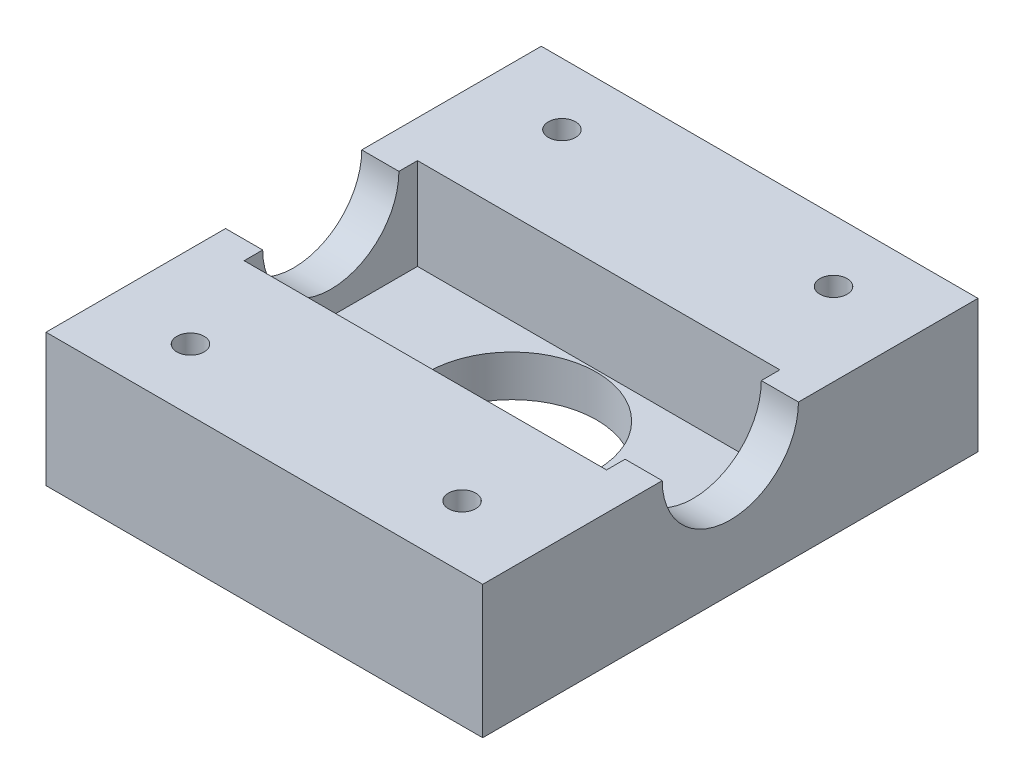
ISO-10303-21;
HEADER;
FILE_DESCRIPTION(('STEP AP214'),'2;1');
FILE_NAME('part.step','',(''),(''),'','','');
FILE_SCHEMA(('AUTOMOTIVE_DESIGN { 1 0 10303 214 1 1 1 1 }'));
ENDSEC;
DATA;
#1=APPLICATION_CONTEXT('core data for automotive mechanical design processes');
#2=APPLICATION_PROTOCOL_DEFINITION('international standard','automotive_design',2000,#1);
#3=PRODUCT_CONTEXT('',#1,'mechanical');
#4=PRODUCT('Part','Part','',(#3));
#5=PRODUCT_RELATED_PRODUCT_CATEGORY('part','',(#4));
#6=PRODUCT_DEFINITION_FORMATION('','',#4);
#7=PRODUCT_DEFINITION_CONTEXT('part definition',#1,'design');
#8=PRODUCT_DEFINITION('design','',#6,#7);
#9=PRODUCT_DEFINITION_SHAPE('','',#8);
#10=(LENGTH_UNIT() NAMED_UNIT(*) SI_UNIT(.MILLI.,.METRE.));
#11=(NAMED_UNIT(*) PLANE_ANGLE_UNIT() SI_UNIT($,.RADIAN.));
#12=(NAMED_UNIT(*) SI_UNIT($,.STERADIAN.) SOLID_ANGLE_UNIT());
#13=UNCERTAINTY_MEASURE_WITH_UNIT(LENGTH_MEASURE(1.E-05),#10,'distance_accuracy_value','');
#14=(GEOMETRIC_REPRESENTATION_CONTEXT(3) GLOBAL_UNCERTAINTY_ASSIGNED_CONTEXT((#13)) GLOBAL_UNIT_ASSIGNED_CONTEXT((#10,
#11,#12)) REPRESENTATION_CONTEXT('',''));
#15=CARTESIAN_POINT('',(0.,0.,0.));
#16=DIRECTION('',(0.,0.,1.));
#17=DIRECTION('',(1.,0.,0.));
#18=AXIS2_PLACEMENT_3D('',#15,#16,#17);
#19=CARTESIAN_POINT('',(0.,16.1,0.));
#20=DIRECTION('',(0.,1.,0.));
#21=DIRECTION('',(0.,0.,1.));
#22=AXIS2_PLACEMENT_3D('',#19,#20,#21);
#23=PLANE('',#22);
#24=CARTESIAN_POINT('',(-16.45,16.1,22.5));
#25=DIRECTION('',(0.,1.,0.));
#26=DIRECTION('',(0.,0.,1.));
#27=AXIS2_PLACEMENT_3D('',#24,#25,#26);
#28=CIRCLE('',#27,1.64999999999999);
#29=CARTESIAN_POINT('',(-16.45,16.1,24.15));
#30=VERTEX_POINT('',#29);
#31=EDGE_CURVE('E162',#30,#30,#28,.T.);
#32=ORIENTED_EDGE('',*,*,#31,.F.);
#33=EDGE_LOOP('',(#32));
#34=FACE_BOUND('',#33,.T.);
#35=CARTESIAN_POINT('',(16.45,16.1,22.5));
#36=DIRECTION('',(0.,1.,0.));
#37=DIRECTION('',(0.,0.,1.));
#38=AXIS2_PLACEMENT_3D('',#35,#36,#37);
#39=CIRCLE('',#38,1.64999999999999);
#40=CARTESIAN_POINT('',(16.45,16.1,24.15));
#41=VERTEX_POINT('',#40);
#42=EDGE_CURVE('E161',#41,#41,#39,.T.);
#43=ORIENTED_EDGE('',*,*,#42,.F.);
#44=EDGE_LOOP('',(#43));
#45=FACE_BOUND('',#44,.T.);
#46=DIRECTION('',(1.,0.,0.));
#47=VECTOR('',#46,1.);
#48=CARTESIAN_POINT('',(-26.45,16.1,8.25000000000002));
#49=LINE('',#48,#47);
#50=CARTESIAN_POINT('',(-26.45,16.1,8.25000000000002));
#51=VERTEX_POINT('',#50);
#52=CARTESIAN_POINT('',(-21.95,16.1,8.25000000000001));
#53=VERTEX_POINT('',#52);
#54=EDGE_CURVE('E67',#51,#53,#49,.T.);
#55=ORIENTED_EDGE('',*,*,#54,.F.);
#56=DIRECTION('',(0.,0.,1.));
#57=VECTOR('',#56,1.);
#58=CARTESIAN_POINT('',(-26.45,16.1,-15.));
#59=LINE('',#58,#57);
#60=CARTESIAN_POINT('',(-26.45,16.1,30.));
#61=VERTEX_POINT('',#60);
#62=EDGE_CURVE('E284',#51,#61,#59,.T.);
#63=ORIENTED_EDGE('',*,*,#62,.T.);
#64=DIRECTION('',(-1.,0.,0.));
#65=VECTOR('',#64,1.);
#66=CARTESIAN_POINT('',(-26.45,16.1,30.));
#67=LINE('',#66,#65);
#68=CARTESIAN_POINT('',(26.45,16.1,30.));
#69=VERTEX_POINT('',#68);
#70=EDGE_CURVE('E220',#69,#61,#67,.T.);
#71=ORIENTED_EDGE('',*,*,#70,.F.);
#72=DIRECTION('',(0.,0.,-1.));
#73=VECTOR('',#72,1.);
#74=CARTESIAN_POINT('',(26.45,16.1,-15.));
#75=LINE('',#74,#73);
#76=CARTESIAN_POINT('',(26.45,16.1,8.25));
#77=VERTEX_POINT('',#76);
#78=EDGE_CURVE('E290',#69,#77,#75,.T.);
#79=ORIENTED_EDGE('',*,*,#78,.T.);
#80=CARTESIAN_POINT('',(21.95,16.1,8.25));
#81=VERTEX_POINT('',#80);
#82=EDGE_CURVE('E233',#81,#77,#49,.T.);
#83=ORIENTED_EDGE('',*,*,#82,.F.);
#84=DIRECTION('',(0.,0.,-1.));
#85=VECTOR('',#84,1.);
#86=CARTESIAN_POINT('',(21.95,16.1,-10.5));
#87=LINE('',#86,#85);
#88=CARTESIAN_POINT('',(21.95,16.1,10.5));
#89=VERTEX_POINT('',#88);
#90=EDGE_CURVE('E249',#89,#81,#87,.T.);
#91=ORIENTED_EDGE('',*,*,#90,.F.);
#92=DIRECTION('',(1.,0.,0.));
#93=VECTOR('',#92,1.);
#94=CARTESIAN_POINT('',(-21.95,16.1,10.5));
#95=LINE('',#94,#93);
#96=CARTESIAN_POINT('',(-21.95,16.1,10.5));
#97=VERTEX_POINT('',#96);
#98=EDGE_CURVE('E244',#97,#89,#95,.T.);
#99=ORIENTED_EDGE('',*,*,#98,.F.);
#100=DIRECTION('',(0.,0.,1.));
#101=VECTOR('',#100,1.);
#102=CARTESIAN_POINT('',(-21.95,16.1,-10.5));
#103=LINE('',#102,#101);
#104=EDGE_CURVE('E245',#53,#97,#103,.T.);
#105=ORIENTED_EDGE('',*,*,#104,.F.);
#106=EDGE_LOOP('',(#55,#63,#71,#79,#83,#91,#99,#105));
#107=FACE_BOUND('',#106,.T.);
#108=ADVANCED_FACE('F51',(#34,#45,#107),#23,.T.);
#109=CARTESIAN_POINT('',(0.,5.,0.));
#110=DIRECTION('',(0.,1.,0.));
#111=DIRECTION('',(0.,0.,1.));
#112=AXIS2_PLACEMENT_3D('',#109,#110,#111);
#113=PLANE('',#112);
#114=DIRECTION('',(0.,0.,1.));
#115=VECTOR('',#114,1.);
#116=CARTESIAN_POINT('',(-21.95,5.,-10.5));
#117=LINE('',#116,#115);
#118=CARTESIAN_POINT('',(-21.95,5.,-10.5));
#119=VERTEX_POINT('',#118);
#120=CARTESIAN_POINT('',(-21.95,5.,10.5));
#121=VERTEX_POINT('',#120);
#122=EDGE_CURVE('E257',#119,#121,#117,.T.);
#123=ORIENTED_EDGE('',*,*,#122,.T.);
#124=DIRECTION('',(1.,0.,0.));
#125=VECTOR('',#124,1.);
#126=CARTESIAN_POINT('',(-21.95,5.,10.5));
#127=LINE('',#126,#125);
#128=CARTESIAN_POINT('',(21.95,5.,10.5));
#129=VERTEX_POINT('',#128);
#130=EDGE_CURVE('E260',#121,#129,#127,.T.);
#131=ORIENTED_EDGE('',*,*,#130,.T.);
#132=DIRECTION('',(0.,0.,-1.));
#133=VECTOR('',#132,1.);
#134=CARTESIAN_POINT('',(21.95,5.,-10.5));
#135=LINE('',#134,#133);
#136=CARTESIAN_POINT('',(21.95,5.,-10.5));
#137=VERTEX_POINT('',#136);
#138=EDGE_CURVE('E263',#129,#137,#135,.T.);
#139=ORIENTED_EDGE('',*,*,#138,.T.);
#140=DIRECTION('',(-1.,0.,0.));
#141=VECTOR('',#140,1.);
#142=CARTESIAN_POINT('',(-21.95,5.,-10.5));
#143=LINE('',#142,#141);
#144=EDGE_CURVE('E266',#137,#119,#143,.T.);
#145=ORIENTED_EDGE('',*,*,#144,.T.);
#146=EDGE_LOOP('',(#123,#131,#139,#145));
#147=FACE_BOUND('',#146,.T.);
#148=CARTESIAN_POINT('',(0.,5.,0.));
#149=DIRECTION('',(0.,1.,0.));
#150=DIRECTION('',(0.,0.,1.));
#151=AXIS2_PLACEMENT_3D('',#148,#149,#150);
#152=CIRCLE('',#151,10.25);
#153=CARTESIAN_POINT('',(0.,5.,10.25));
#154=VERTEX_POINT('',#153);
#155=EDGE_CURVE('E295',#154,#154,#152,.T.);
#156=ORIENTED_EDGE('',*,*,#155,.F.);
#157=EDGE_LOOP('',(#156));
#158=FACE_BOUND('',#157,.T.);
#159=ADVANCED_FACE('F396',(#147,#158),#113,.T.);
#160=CARTESIAN_POINT('',(0.,0.,0.));
#161=DIRECTION('',(0.,1.,0.));
#162=DIRECTION('',(0.,0.,1.));
#163=AXIS2_PLACEMENT_3D('',#160,#161,#162);
#164=PLANE('',#163);
#165=DIRECTION('',(0.,0.,-1.));
#166=VECTOR('',#165,1.);
#167=CARTESIAN_POINT('',(26.45,0.,-15.));
#168=LINE('',#167,#166);
#169=CARTESIAN_POINT('',(26.45,0.,30.));
#170=VERTEX_POINT('',#169);
#171=CARTESIAN_POINT('',(26.45,0.,-30.));
#172=VERTEX_POINT('',#171);
#173=EDGE_CURVE('E299',#170,#172,#168,.T.);
#174=ORIENTED_EDGE('',*,*,#173,.F.);
#175=DIRECTION('',(1.,0.,0.));
#176=VECTOR('',#175,1.);
#177=CARTESIAN_POINT('',(26.45,0.,30.));
#178=LINE('',#177,#176);
#179=CARTESIAN_POINT('',(-26.45,0.,30.));
#180=VERTEX_POINT('',#179);
#181=EDGE_CURVE('E196',#180,#170,#178,.T.);
#182=ORIENTED_EDGE('',*,*,#181,.F.);
#183=DIRECTION('',(0.,0.,1.));
#184=VECTOR('',#183,1.);
#185=CARTESIAN_POINT('',(-26.45,0.,-15.));
#186=LINE('',#185,#184);
#187=CARTESIAN_POINT('',(-26.45,0.,-30.));
#188=VERTEX_POINT('',#187);
#189=EDGE_CURVE('E60',#188,#180,#186,.T.);
#190=ORIENTED_EDGE('',*,*,#189,.F.);
#191=DIRECTION('',(-1.,0.,0.));
#192=VECTOR('',#191,1.);
#193=CARTESIAN_POINT('',(-26.45,0.,-30.));
#194=LINE('',#193,#192);
#195=EDGE_CURVE('E192',#172,#188,#194,.T.);
#196=ORIENTED_EDGE('',*,*,#195,.F.);
#197=EDGE_LOOP('',(#174,#182,#190,#196));
#198=FACE_BOUND('',#197,.T.);
#199=CARTESIAN_POINT('',(0.,0.,0.));
#200=DIRECTION('',(0.,1.,0.));
#201=DIRECTION('',(0.,0.,1.));
#202=AXIS2_PLACEMENT_3D('',#199,#200,#201);
#203=CIRCLE('',#202,10.25);
#204=CARTESIAN_POINT('',(0.,0.,10.25));
#205=VERTEX_POINT('',#204);
#206=EDGE_CURVE('E294',#205,#205,#203,.T.);
#207=ORIENTED_EDGE('',*,*,#206,.T.);
#208=EDGE_LOOP('',(#207));
#209=FACE_BOUND('',#208,.T.);
#210=ADVANCED_FACE('F317',(#198,#209),#164,.F.);
#211=CARTESIAN_POINT('',(26.45,5.,-15.));
#212=DIRECTION('',(-1.,0.,0.));
#213=DIRECTION('',(0.,0.,1.));
#214=AXIS2_PLACEMENT_3D('',#211,#212,#213);
#215=PLANE('',#214);
#216=ORIENTED_EDGE('',*,*,#173,.T.);
#217=DIRECTION('',(0.,-1.,0.));
#218=VECTOR('',#217,1.);
#219=CARTESIAN_POINT('',(26.45,16.1,-30.));
#220=LINE('',#219,#218);
#221=CARTESIAN_POINT('',(26.45,16.1,-30.));
#222=VERTEX_POINT('',#221);
#223=EDGE_CURVE('E200',#222,#172,#220,.T.);
#224=ORIENTED_EDGE('',*,*,#223,.F.);
#225=CARTESIAN_POINT('',(26.45,16.1,-8.25));
#226=VERTEX_POINT('',#225);
#227=EDGE_CURVE('E289',#226,#222,#75,.T.);
#228=ORIENTED_EDGE('',*,*,#227,.F.);
#229=CARTESIAN_POINT('',(26.45,16.1,0.));
#230=DIRECTION('',(1.,0.,0.));
#231=DIRECTION('',(0.,0.,-1.));
#232=AXIS2_PLACEMENT_3D('',#229,#230,#231);
#233=CIRCLE('',#232,8.25);
#234=EDGE_CURVE('E224',#77,#226,#233,.T.);
#235=ORIENTED_EDGE('',*,*,#234,.F.);
#236=ORIENTED_EDGE('',*,*,#78,.F.);
#237=DIRECTION('',(0.,1.,0.));
#238=VECTOR('',#237,1.);
#239=CARTESIAN_POINT('',(26.45,16.1,30.));
#240=LINE('',#239,#238);
#241=EDGE_CURVE('E216',#170,#69,#240,.T.);
#242=ORIENTED_EDGE('',*,*,#241,.F.);
#243=EDGE_LOOP('',(#216,#224,#228,#235,#236,#242));
#244=FACE_BOUND('',#243,.T.);
#245=ADVANCED_FACE('F53',(#244),#215,.F.);
#246=CARTESIAN_POINT('',(-26.45,5.,-15.));
#247=DIRECTION('',(1.,0.,0.));
#248=DIRECTION('',(0.,0.,-1.));
#249=AXIS2_PLACEMENT_3D('',#246,#247,#248);
#250=PLANE('',#249);
#251=DIRECTION('',(0.,1.,0.));
#252=VECTOR('',#251,1.);
#253=CARTESIAN_POINT('',(-26.45,16.1,-30.));
#254=LINE('',#253,#252);
#255=CARTESIAN_POINT('',(-26.45,16.1,-30.));
#256=VERTEX_POINT('',#255);
#257=EDGE_CURVE('E204',#188,#256,#254,.T.);
#258=ORIENTED_EDGE('',*,*,#257,.F.);
#259=ORIENTED_EDGE('',*,*,#189,.T.);
#260=DIRECTION('',(0.,-1.,0.));
#261=VECTOR('',#260,1.);
#262=CARTESIAN_POINT('',(-26.45,16.1,30.));
#263=LINE('',#262,#261);
#264=EDGE_CURVE('E212',#61,#180,#263,.T.);
#265=ORIENTED_EDGE('',*,*,#264,.F.);
#266=ORIENTED_EDGE('',*,*,#62,.F.);
#267=CARTESIAN_POINT('',(-26.45,16.1,0.));
#268=DIRECTION('',(1.,0.,0.));
#269=DIRECTION('',(0.,0.,-1.));
#270=AXIS2_PLACEMENT_3D('',#267,#268,#269);
#271=CIRCLE('',#270,8.25);
#272=CARTESIAN_POINT('',(-26.45,16.1,-8.24999999999998));
#273=VERTEX_POINT('',#272);
#274=EDGE_CURVE('E225',#51,#273,#271,.T.);
#275=ORIENTED_EDGE('',*,*,#274,.T.);
#276=EDGE_CURVE('E285',#256,#273,#59,.T.);
#277=ORIENTED_EDGE('',*,*,#276,.F.);
#278=EDGE_LOOP('',(#258,#259,#265,#266,#275,#277));
#279=FACE_BOUND('',#278,.T.);
#280=ADVANCED_FACE('F309',(#279),#250,.F.);
#281=CARTESIAN_POINT('',(0.,5.,0.));
#282=DIRECTION('',(0.,-1.,0.));
#283=DIRECTION('',(0.,0.,-1.));
#284=AXIS2_PLACEMENT_3D('',#281,#282,#283);
#285=CYLINDRICAL_SURFACE('',#284,10.25);
#286=ORIENTED_EDGE('',*,*,#155,.T.);
#287=EDGE_LOOP('',(#286));
#288=FACE_BOUND('',#287,.T.);
#289=ORIENTED_EDGE('',*,*,#206,.F.);
#290=EDGE_LOOP('',(#289));
#291=FACE_BOUND('',#290,.T.);
#292=ADVANCED_FACE('F426',(#288,#291),#285,.F.);
#293=CARTESIAN_POINT('',(16.45,16.1,-22.5));
#294=DIRECTION('',(0.,1.,0.));
#295=DIRECTION('',(0.,0.,1.));
#296=AXIS2_PLACEMENT_3D('',#293,#294,#295);
#297=CIRCLE('',#296,1.64999999999999);
#298=CARTESIAN_POINT('',(16.45,16.1,-20.85));
#299=VERTEX_POINT('',#298);
#300=EDGE_CURVE('E176',#299,#299,#297,.T.);
#301=ORIENTED_EDGE('',*,*,#300,.F.);
#302=EDGE_LOOP('',(#301));
#303=FACE_BOUND('',#302,.T.);
#304=CARTESIAN_POINT('',(-16.45,16.1,-22.5));
#305=DIRECTION('',(0.,1.,0.));
#306=DIRECTION('',(0.,0.,1.));
#307=AXIS2_PLACEMENT_3D('',#304,#305,#306);
#308=CIRCLE('',#307,1.64999999999999);
#309=CARTESIAN_POINT('',(-16.45,16.1,-20.85));
#310=VERTEX_POINT('',#309);
#311=EDGE_CURVE('E184',#310,#310,#308,.T.);
#312=ORIENTED_EDGE('',*,*,#311,.F.);
#313=EDGE_LOOP('',(#312));
#314=FACE_BOUND('',#313,.T.);
#315=DIRECTION('',(1.,0.,0.));
#316=VECTOR('',#315,1.);
#317=CARTESIAN_POINT('',(-26.45,16.1,-8.24999999999998));
#318=LINE('',#317,#316);
#319=CARTESIAN_POINT('',(21.95,16.1,-8.25));
#320=VERTEX_POINT('',#319);
#321=EDGE_CURVE('E74',#226,#320,#318,.F.);
#322=ORIENTED_EDGE('',*,*,#321,.F.);
#323=ORIENTED_EDGE('',*,*,#227,.T.);
#324=DIRECTION('',(1.,0.,0.));
#325=VECTOR('',#324,1.);
#326=CARTESIAN_POINT('',(26.45,16.1,-30.));
#327=LINE('',#326,#325);
#328=EDGE_CURVE('E208',#256,#222,#327,.T.);
#329=ORIENTED_EDGE('',*,*,#328,.F.);
#330=ORIENTED_EDGE('',*,*,#276,.T.);
#331=CARTESIAN_POINT('',(-21.95,16.1,-8.24999999999998));
#332=VERTEX_POINT('',#331);
#333=EDGE_CURVE('E234',#332,#273,#318,.F.);
#334=ORIENTED_EDGE('',*,*,#333,.F.);
#335=CARTESIAN_POINT('',(-21.95,16.1,-10.5));
#336=VERTEX_POINT('',#335);
#337=EDGE_CURVE('E240',#336,#332,#103,.T.);
#338=ORIENTED_EDGE('',*,*,#337,.F.);
#339=DIRECTION('',(-1.,0.,0.));
#340=VECTOR('',#339,1.);
#341=CARTESIAN_POINT('',(-21.95,16.1,-10.5));
#342=LINE('',#341,#340);
#343=CARTESIAN_POINT('',(21.95,16.1,-10.5));
#344=VERTEX_POINT('',#343);
#345=EDGE_CURVE('E253',#344,#336,#342,.T.);
#346=ORIENTED_EDGE('',*,*,#345,.F.);
#347=EDGE_CURVE('E248',#320,#344,#87,.T.);
#348=ORIENTED_EDGE('',*,*,#347,.F.);
#349=EDGE_LOOP('',(#322,#323,#329,#330,#334,#338,#346,#348));
#350=FACE_BOUND('',#349,.T.);
#351=ADVANCED_FACE('F374',(#303,#314,#350),#23,.T.);
#352=CARTESIAN_POINT('',(-21.95,16.1,-10.5));
#353=DIRECTION('',(1.,0.,0.));
#354=DIRECTION('',(0.,0.,-1.));
#355=AXIS2_PLACEMENT_3D('',#352,#353,#354);
#356=PLANE('',#355);
#357=CARTESIAN_POINT('',(-21.95,16.1,0.));
#358=DIRECTION('',(1.,0.,0.));
#359=DIRECTION('',(0.,0.,-1.));
#360=AXIS2_PLACEMENT_3D('',#357,#358,#359);
#361=CIRCLE('',#360,8.25);
#362=EDGE_CURVE('E237',#53,#332,#361,.T.);
#363=ORIENTED_EDGE('',*,*,#362,.F.);
#364=ORIENTED_EDGE('',*,*,#104,.T.);
#365=DIRECTION('',(0.,-1.,0.));
#366=VECTOR('',#365,1.);
#367=CARTESIAN_POINT('',(-21.95,16.1,10.5));
#368=LINE('',#367,#366);
#369=EDGE_CURVE('E280',#97,#121,#368,.T.);
#370=ORIENTED_EDGE('',*,*,#369,.T.);
#371=ORIENTED_EDGE('',*,*,#122,.F.);
#372=DIRECTION('',(0.,-1.,0.));
#373=VECTOR('',#372,1.);
#374=CARTESIAN_POINT('',(-21.95,16.1,-10.5));
#375=LINE('',#374,#373);
#376=EDGE_CURVE('E256',#336,#119,#375,.T.);
#377=ORIENTED_EDGE('',*,*,#376,.F.);
#378=ORIENTED_EDGE('',*,*,#337,.T.);
#379=EDGE_LOOP('',(#363,#364,#370,#371,#377,#378));
#380=FACE_BOUND('',#379,.T.);
#381=ADVANCED_FACE('F400',(#380),#356,.T.);
#382=CARTESIAN_POINT('',(-21.95,16.1,10.5));
#383=DIRECTION('',(0.,0.,-1.));
#384=DIRECTION('',(-1.,0.,0.));
#385=AXIS2_PLACEMENT_3D('',#382,#383,#384);
#386=PLANE('',#385);
#387=ORIENTED_EDGE('',*,*,#130,.F.);
#388=ORIENTED_EDGE('',*,*,#369,.F.);
#389=ORIENTED_EDGE('',*,*,#98,.T.);
#390=DIRECTION('',(0.,-1.,0.));
#391=VECTOR('',#390,1.);
#392=CARTESIAN_POINT('',(21.95,16.1,10.5));
#393=LINE('',#392,#391);
#394=EDGE_CURVE('E276',#89,#129,#393,.T.);
#395=ORIENTED_EDGE('',*,*,#394,.T.);
#396=EDGE_LOOP('',(#387,#388,#389,#395));
#397=FACE_BOUND('',#396,.T.);
#398=ADVANCED_FACE('F404',(#397),#386,.T.);
#399=CARTESIAN_POINT('',(21.95,16.1,-10.5));
#400=DIRECTION('',(-1.,0.,0.));
#401=DIRECTION('',(0.,0.,1.));
#402=AXIS2_PLACEMENT_3D('',#399,#400,#401);
#403=PLANE('',#402);
#404=CARTESIAN_POINT('',(21.95,16.1,0.));
#405=DIRECTION('',(-1.,0.,0.));
#406=DIRECTION('',(0.,0.,1.));
#407=AXIS2_PLACEMENT_3D('',#404,#405,#406);
#408=CIRCLE('',#407,8.25);
#409=EDGE_CURVE('E11',#320,#81,#408,.T.);
#410=ORIENTED_EDGE('',*,*,#409,.F.);
#411=ORIENTED_EDGE('',*,*,#347,.T.);
#412=DIRECTION('',(0.,-1.,0.));
#413=VECTOR('',#412,1.);
#414=CARTESIAN_POINT('',(21.95,16.1,-10.5));
#415=LINE('',#414,#413);
#416=EDGE_CURVE('E272',#344,#137,#415,.T.);
#417=ORIENTED_EDGE('',*,*,#416,.T.);
#418=ORIENTED_EDGE('',*,*,#138,.F.);
#419=ORIENTED_EDGE('',*,*,#394,.F.);
#420=ORIENTED_EDGE('',*,*,#90,.T.);
#421=EDGE_LOOP('',(#410,#411,#417,#418,#419,#420));
#422=FACE_BOUND('',#421,.T.);
#423=ADVANCED_FACE('F388',(#422),#403,.T.);
#424=CARTESIAN_POINT('',(-21.95,16.1,-10.5));
#425=DIRECTION('',(0.,0.,1.));
#426=DIRECTION('',(1.,0.,0.));
#427=AXIS2_PLACEMENT_3D('',#424,#425,#426);
#428=PLANE('',#427);
#429=ORIENTED_EDGE('',*,*,#144,.F.);
#430=ORIENTED_EDGE('',*,*,#416,.F.);
#431=ORIENTED_EDGE('',*,*,#345,.T.);
#432=ORIENTED_EDGE('',*,*,#376,.T.);
#433=EDGE_LOOP('',(#429,#430,#431,#432));
#434=FACE_BOUND('',#433,.T.);
#435=ADVANCED_FACE('F392',(#434),#428,.T.);
#436=CARTESIAN_POINT('',(-26.45,16.1,0.));
#437=DIRECTION('',(1.,0.,0.));
#438=DIRECTION('',(0.,0.,-1.));
#439=AXIS2_PLACEMENT_3D('',#436,#437,#438);
#440=CYLINDRICAL_SURFACE('',#439,8.25);
#441=ORIENTED_EDGE('',*,*,#82,.T.);
#442=ORIENTED_EDGE('',*,*,#234,.T.);
#443=ORIENTED_EDGE('',*,*,#321,.T.);
#444=ORIENTED_EDGE('',*,*,#409,.T.);
#445=EDGE_LOOP('',(#441,#442,#443,#444));
#446=FACE_BOUND('',#445,.T.);
#447=ADVANCED_FACE('F383',(#446),#440,.F.);
#448=ORIENTED_EDGE('',*,*,#54,.T.);
#449=ORIENTED_EDGE('',*,*,#362,.T.);
#450=ORIENTED_EDGE('',*,*,#333,.T.);
#451=ORIENTED_EDGE('',*,*,#274,.F.);
#452=EDGE_LOOP('',(#448,#449,#450,#451));
#453=FACE_BOUND('',#452,.T.);
#454=ADVANCED_FACE('F370',(#453),#440,.F.);
#455=CARTESIAN_POINT('',(0.,0.,30.));
#456=DIRECTION('',(0.,0.,1.));
#457=DIRECTION('',(1.,0.,0.));
#458=AXIS2_PLACEMENT_3D('',#455,#456,#457);
#459=PLANE('',#458);
#460=ORIENTED_EDGE('',*,*,#264,.T.);
#461=ORIENTED_EDGE('',*,*,#181,.T.);
#462=ORIENTED_EDGE('',*,*,#241,.T.);
#463=ORIENTED_EDGE('',*,*,#70,.T.);
#464=EDGE_LOOP('',(#460,#461,#462,#463));
#465=FACE_BOUND('',#464,.T.);
#466=ADVANCED_FACE('F315',(#465),#459,.T.);
#467=CARTESIAN_POINT('',(0.,0.,-30.));
#468=DIRECTION('',(0.,0.,-1.));
#469=DIRECTION('',(-1.,0.,0.));
#470=AXIS2_PLACEMENT_3D('',#467,#468,#469);
#471=PLANE('',#470);
#472=ORIENTED_EDGE('',*,*,#223,.T.);
#473=ORIENTED_EDGE('',*,*,#195,.T.);
#474=ORIENTED_EDGE('',*,*,#257,.T.);
#475=ORIENTED_EDGE('',*,*,#328,.T.);
#476=EDGE_LOOP('',(#472,#473,#474,#475));
#477=FACE_BOUND('',#476,.T.);
#478=ADVANCED_FACE('F377',(#477),#471,.T.);
#479=CARTESIAN_POINT('',(-16.45,6.99142002139548,-22.5));
#480=DIRECTION('',(0.,1.,0.));
#481=DIRECTION('',(0.,0.,1.));
#482=AXIS2_PLACEMENT_3D('',#479,#480,#481);
#483=CONICAL_SURFACE('',#482,1.65,1.02974425867665);
#484=CARTESIAN_POINT('',(-16.45,6.,-22.5));
#485=VERTEX_POINT('',#484);
#486=VERTEX_LOOP('',#485);
#487=FACE_BOUND('',#486,.T.);
#488=CARTESIAN_POINT('',(-16.45,6.99142002139548,-22.5));
#489=DIRECTION('',(0.,1.,0.));
#490=DIRECTION('',(0.,0.,1.));
#491=AXIS2_PLACEMENT_3D('',#488,#489,#490);
#492=CIRCLE('',#491,1.65);
#493=CARTESIAN_POINT('',(-16.45,6.99142002139548,-20.85));
#494=VERTEX_POINT('',#493);
#495=EDGE_CURVE('E188',#494,#494,#492,.T.);
#496=ORIENTED_EDGE('',*,*,#495,.T.);
#497=EDGE_LOOP('',(#496));
#498=FACE_BOUND('',#497,.T.);
#499=ADVANCED_FACE('F439',(#487,#498),#483,.F.);
#500=CARTESIAN_POINT('',(-16.45,16.1,-22.5));
#501=DIRECTION('',(0.,1.,0.));
#502=DIRECTION('',(0.,0.,1.));
#503=AXIS2_PLACEMENT_3D('',#500,#501,#502);
#504=CYLINDRICAL_SURFACE('',#503,1.64999999999999);
#505=ORIENTED_EDGE('',*,*,#495,.F.);
#506=EDGE_LOOP('',(#505));
#507=FACE_BOUND('',#506,.T.);
#508=ORIENTED_EDGE('',*,*,#311,.T.);
#509=EDGE_LOOP('',(#508));
#510=FACE_BOUND('',#509,.T.);
#511=ADVANCED_FACE('F436',(#507,#510),#504,.F.);
#512=CARTESIAN_POINT('',(16.45,6.99142002139548,-22.5));
#513=DIRECTION('',(0.,1.,0.));
#514=DIRECTION('',(0.,0.,1.));
#515=AXIS2_PLACEMENT_3D('',#512,#513,#514);
#516=CONICAL_SURFACE('',#515,1.65,1.02974425867665);
#517=CARTESIAN_POINT('',(16.45,6.,-22.5));
#518=VERTEX_POINT('',#517);
#519=VERTEX_LOOP('',#518);
#520=FACE_BOUND('',#519,.T.);
#521=CARTESIAN_POINT('',(16.45,6.99142002139548,-22.5));
#522=DIRECTION('',(0.,1.,0.));
#523=DIRECTION('',(0.,0.,1.));
#524=AXIS2_PLACEMENT_3D('',#521,#522,#523);
#525=CIRCLE('',#524,1.65);
#526=CARTESIAN_POINT('',(16.45,6.99142002139548,-20.85));
#527=VERTEX_POINT('',#526);
#528=EDGE_CURVE('E180',#527,#527,#525,.T.);
#529=ORIENTED_EDGE('',*,*,#528,.T.);
#530=EDGE_LOOP('',(#529));
#531=FACE_BOUND('',#530,.T.);
#532=ADVANCED_FACE('F438',(#520,#531),#516,.F.);
#533=CARTESIAN_POINT('',(16.45,16.1,-22.5));
#534=DIRECTION('',(0.,1.,0.));
#535=DIRECTION('',(0.,0.,1.));
#536=AXIS2_PLACEMENT_3D('',#533,#534,#535);
#537=CYLINDRICAL_SURFACE('',#536,1.65);
#538=ORIENTED_EDGE('',*,*,#528,.F.);
#539=EDGE_LOOP('',(#538));
#540=FACE_BOUND('',#539,.T.);
#541=ORIENTED_EDGE('',*,*,#300,.T.);
#542=EDGE_LOOP('',(#541));
#543=FACE_BOUND('',#542,.T.);
#544=ADVANCED_FACE('F446',(#540,#543),#537,.F.);
#545=CARTESIAN_POINT('',(16.45,6.99142002139548,22.5));
#546=DIRECTION('',(0.,1.,0.));
#547=DIRECTION('',(0.,0.,1.));
#548=AXIS2_PLACEMENT_3D('',#545,#546,#547);
#549=CONICAL_SURFACE('',#548,1.65,1.02974425867665);
#550=CARTESIAN_POINT('',(16.45,6.,22.5));
#551=VERTEX_POINT('',#550);
#552=VERTEX_LOOP('',#551);
#553=FACE_BOUND('',#552,.T.);
#554=CARTESIAN_POINT('',(16.45,6.99142002139548,22.5));
#555=DIRECTION('',(0.,1.,0.));
#556=DIRECTION('',(0.,0.,1.));
#557=AXIS2_PLACEMENT_3D('',#554,#555,#556);
#558=CIRCLE('',#557,1.65);
#559=CARTESIAN_POINT('',(16.45,6.99142002139548,24.15));
#560=VERTEX_POINT('',#559);
#561=EDGE_CURVE('E168',#560,#560,#558,.T.);
#562=ORIENTED_EDGE('',*,*,#561,.T.);
#563=EDGE_LOOP('',(#562));
#564=FACE_BOUND('',#563,.T.);
#565=ADVANCED_FACE('F508',(#553,#564),#549,.F.);
#566=CARTESIAN_POINT('',(16.45,16.1,22.5));
#567=DIRECTION('',(0.,1.,0.));
#568=DIRECTION('',(0.,0.,1.));
#569=AXIS2_PLACEMENT_3D('',#566,#567,#568);
#570=CYLINDRICAL_SURFACE('',#569,1.65);
#571=ORIENTED_EDGE('',*,*,#561,.F.);
#572=EDGE_LOOP('',(#571));
#573=FACE_BOUND('',#572,.T.);
#574=ORIENTED_EDGE('',*,*,#42,.T.);
#575=EDGE_LOOP('',(#574));
#576=FACE_BOUND('',#575,.T.);
#577=ADVANCED_FACE('F154',(#573,#576),#570,.F.);
#578=CARTESIAN_POINT('',(-16.45,6.99142002139548,22.5));
#579=DIRECTION('',(0.,1.,0.));
#580=DIRECTION('',(0.,0.,1.));
#581=AXIS2_PLACEMENT_3D('',#578,#579,#580);
#582=CONICAL_SURFACE('',#581,1.65,1.02974425867665);
#583=CARTESIAN_POINT('',(-16.45,6.,22.5));
#584=VERTEX_POINT('',#583);
#585=VERTEX_LOOP('',#584);
#586=FACE_BOUND('',#585,.T.);
#587=CARTESIAN_POINT('',(-16.45,6.99142002139548,22.5));
#588=DIRECTION('',(0.,1.,0.));
#589=DIRECTION('',(0.,0.,1.));
#590=AXIS2_PLACEMENT_3D('',#587,#588,#589);
#591=CIRCLE('',#590,1.65);
#592=CARTESIAN_POINT('',(-16.45,6.99142002139548,24.15));
#593=VERTEX_POINT('',#592);
#594=EDGE_CURVE('E158',#593,#593,#591,.T.);
#595=ORIENTED_EDGE('',*,*,#594,.T.);
#596=EDGE_LOOP('',(#595));
#597=FACE_BOUND('',#596,.T.);
#598=ADVANCED_FACE('F150',(#586,#597),#582,.F.);
#599=CARTESIAN_POINT('',(-16.45,16.1,22.5));
#600=DIRECTION('',(0.,1.,0.));
#601=DIRECTION('',(0.,0.,1.));
#602=AXIS2_PLACEMENT_3D('',#599,#600,#601);
#603=CYLINDRICAL_SURFACE('',#602,1.64999999999999);
#604=ORIENTED_EDGE('',*,*,#594,.F.);
#605=EDGE_LOOP('',(#604));
#606=FACE_BOUND('',#605,.T.);
#607=ORIENTED_EDGE('',*,*,#31,.T.);
#608=EDGE_LOOP('',(#607));
#609=FACE_BOUND('',#608,.T.);
#610=ADVANCED_FACE('F153',(#606,#609),#603,.F.);
#611=CLOSED_SHELL('',(#108,#159,#210,#245,#280,#292,#351,#381,#398,#423,#435,#447,#454,#466,
#478,#499,#511,#532,#544,#565,#577,#598,#610));
#612=MANIFOLD_SOLID_BREP('B2',#611);
#613=ADVANCED_BREP_SHAPE_REPRESENTATION('',(#18,#612),#14);
#614=SHAPE_DEFINITION_REPRESENTATION(#9,#613);
ENDSEC;
END-ISO-10303-21;
